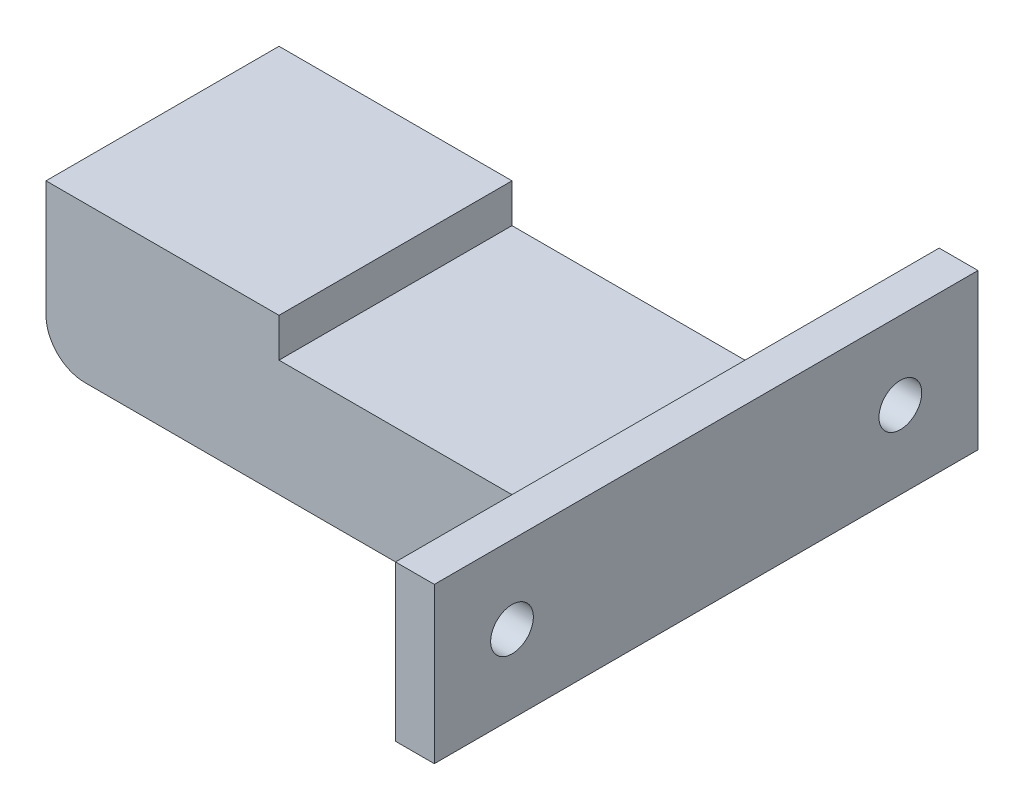
ISO-10303-21;
HEADER;
FILE_DESCRIPTION(('STEP AP214'),'2;1');
FILE_NAME('part.step','',(''),(''),'','','');
FILE_SCHEMA(('AUTOMOTIVE_DESIGN { 1 0 10303 214 1 1 1 1 }'));
ENDSEC;
DATA;
#1=APPLICATION_CONTEXT('core data for automotive mechanical design processes');
#2=APPLICATION_PROTOCOL_DEFINITION('international standard','automotive_design',2000,#1);
#3=PRODUCT_CONTEXT('',#1,'mechanical');
#4=PRODUCT('Part','Part','',(#3));
#5=PRODUCT_RELATED_PRODUCT_CATEGORY('part','',(#4));
#6=PRODUCT_DEFINITION_FORMATION('','',#4);
#7=PRODUCT_DEFINITION_CONTEXT('part definition',#1,'design');
#8=PRODUCT_DEFINITION('design','',#6,#7);
#9=PRODUCT_DEFINITION_SHAPE('','',#8);
#10=(LENGTH_UNIT() NAMED_UNIT(*) SI_UNIT(.MILLI.,.METRE.));
#11=(NAMED_UNIT(*) PLANE_ANGLE_UNIT() SI_UNIT($,.RADIAN.));
#12=(NAMED_UNIT(*) SI_UNIT($,.STERADIAN.) SOLID_ANGLE_UNIT());
#13=UNCERTAINTY_MEASURE_WITH_UNIT(LENGTH_MEASURE(1.E-05),#10,'distance_accuracy_value','');
#14=(GEOMETRIC_REPRESENTATION_CONTEXT(3) GLOBAL_UNCERTAINTY_ASSIGNED_CONTEXT((#13)) GLOBAL_UNIT_ASSIGNED_CONTEXT((#10,
#11,#12)) REPRESENTATION_CONTEXT('',''));
#15=CARTESIAN_POINT('',(0.,0.,0.));
#16=DIRECTION('',(0.,0.,1.));
#17=DIRECTION('',(1.,0.,0.));
#18=AXIS2_PLACEMENT_3D('',#15,#16,#17);
#19=CARTESIAN_POINT('',(0.,20.,0.));
#20=DIRECTION('',(0.,-1.,0.));
#21=DIRECTION('',(0.,0.,-1.));
#22=AXIS2_PLACEMENT_3D('',#19,#20,#21);
#23=PLANE('',#22);
#24=DIRECTION('',(1.,0.,0.));
#25=VECTOR('',#24,1.);
#26=CARTESIAN_POINT('',(65.,20.,-50.));
#27=LINE('',#26,#25);
#28=CARTESIAN_POINT('',(65.,20.,-50.));
#29=VERTEX_POINT('',#28);
#30=CARTESIAN_POINT('',(70.,20.,-50.));
#31=VERTEX_POINT('',#30);
#32=EDGE_CURVE('E198',#29,#31,#27,.T.);
#33=ORIENTED_EDGE('',*,*,#32,.F.);
#34=DIRECTION('',(0.,0.,1.));
#35=VECTOR('',#34,1.);
#36=CARTESIAN_POINT('',(65.,20.,0.));
#37=LINE('',#36,#35);
#38=CARTESIAN_POINT('',(65.,20.,20.));
#39=VERTEX_POINT('',#38);
#40=EDGE_CURVE('E209',#29,#39,#37,.T.);
#41=ORIENTED_EDGE('',*,*,#40,.T.);
#42=DIRECTION('',(1.,0.,0.));
#43=VECTOR('',#42,1.);
#44=CARTESIAN_POINT('',(65.,20.,20.));
#45=LINE('',#44,#43);
#46=CARTESIAN_POINT('',(70.,20.,20.));
#47=VERTEX_POINT('',#46);
#48=EDGE_CURVE('E216',#39,#47,#45,.T.);
#49=ORIENTED_EDGE('',*,*,#48,.T.);
#50=DIRECTION('',(0.,0.,-1.));
#51=VECTOR('',#50,1.);
#52=CARTESIAN_POINT('',(70.,20.,0.));
#53=LINE('',#52,#51);
#54=EDGE_CURVE('E231',#47,#31,#53,.T.);
#55=ORIENTED_EDGE('',*,*,#54,.T.);
#56=EDGE_LOOP('',(#33,#41,#49,#55));
#57=FACE_BOUND('',#56,.T.);
#58=ADVANCED_FACE('F33',(#57),#23,.F.);
#59=CARTESIAN_POINT('',(0.,20.,-30.));
#60=DIRECTION('',(0.,0.,1.));
#61=DIRECTION('',(1.,0.,0.));
#62=AXIS2_PLACEMENT_3D('',#59,#60,#61);
#63=PLANE('',#62);
#64=DIRECTION('',(-1.,0.,0.));
#65=VECTOR('',#64,1.);
#66=CARTESIAN_POINT('',(0.,20.,-30.));
#67=LINE('',#66,#65);
#68=CARTESIAN_POINT('',(30.,20.,-30.));
#69=VERTEX_POINT('',#68);
#70=CARTESIAN_POINT('',(0.,20.,-30.));
#71=VERTEX_POINT('',#70);
#72=EDGE_CURVE('E233',#69,#71,#67,.T.);
#73=ORIENTED_EDGE('',*,*,#72,.F.);
#74=DIRECTION('',(0.,-1.,0.));
#75=VECTOR('',#74,1.);
#76=CARTESIAN_POINT('',(30.,20.,-30.));
#77=LINE('',#76,#75);
#78=CARTESIAN_POINT('',(30.,15.,-30.));
#79=VERTEX_POINT('',#78);
#80=EDGE_CURVE('E178',#69,#79,#77,.T.);
#81=ORIENTED_EDGE('',*,*,#80,.T.);
#82=DIRECTION('',(1.,0.,0.));
#83=VECTOR('',#82,1.);
#84=CARTESIAN_POINT('',(0.,15.,-30.));
#85=LINE('',#84,#83);
#86=CARTESIAN_POINT('',(60.,15.,-30.));
#87=VERTEX_POINT('',#86);
#88=EDGE_CURVE('E134',#79,#87,#85,.T.);
#89=ORIENTED_EDGE('',*,*,#88,.T.);
#90=DIRECTION('',(0.,1.,0.));
#91=VECTOR('',#90,1.);
#92=CARTESIAN_POINT('',(60.,20.,-30.));
#93=LINE('',#92,#91);
#94=CARTESIAN_POINT('',(60.,0.,-30.));
#95=VERTEX_POINT('',#94);
#96=EDGE_CURVE('E151',#87,#95,#93,.F.);
#97=ORIENTED_EDGE('',*,*,#96,.T.);
#98=DIRECTION('',(-1.,0.,0.));
#99=VECTOR('',#98,1.);
#100=CARTESIAN_POINT('',(0.,0.,-30.));
#101=LINE('',#100,#99);
#102=CARTESIAN_POINT('',(5.,0.,-30.));
#103=VERTEX_POINT('',#102);
#104=EDGE_CURVE('E164',#95,#103,#101,.T.);
#105=ORIENTED_EDGE('',*,*,#104,.T.);
#106=CARTESIAN_POINT('',(5.,5.,-30.));
#107=DIRECTION('',(0.,0.,1.));
#108=DIRECTION('',(1.,0.,0.));
#109=AXIS2_PLACEMENT_3D('',#106,#107,#108);
#110=CIRCLE('',#109,5.);
#111=CARTESIAN_POINT('',(0.,5.,-30.));
#112=VERTEX_POINT('',#111);
#113=EDGE_CURVE('E148',#103,#112,#110,.F.);
#114=ORIENTED_EDGE('',*,*,#113,.T.);
#115=DIRECTION('',(0.,-1.,0.));
#116=VECTOR('',#115,1.);
#117=CARTESIAN_POINT('',(0.,20.,-30.));
#118=LINE('',#117,#116);
#119=EDGE_CURVE('E235',#71,#112,#118,.T.);
#120=ORIENTED_EDGE('',*,*,#119,.F.);
#121=EDGE_LOOP('',(#73,#81,#89,#97,#105,#114,#120));
#122=FACE_BOUND('',#121,.T.);
#123=ADVANCED_FACE('F177',(#122),#63,.F.);
#124=CARTESIAN_POINT('',(0.,20.,0.));
#125=DIRECTION('',(1.,0.,0.));
#126=DIRECTION('',(0.,0.,-1.));
#127=AXIS2_PLACEMENT_3D('',#124,#125,#126);
#128=PLANE('',#127);
#129=ORIENTED_EDGE('',*,*,#119,.T.);
#130=DIRECTION('',(0.,0.,1.));
#131=VECTOR('',#130,1.);
#132=CARTESIAN_POINT('',(0.,5.,0.));
#133=LINE('',#132,#131);
#134=CARTESIAN_POINT('',(0.,5.,0.));
#135=VERTEX_POINT('',#134);
#136=EDGE_CURVE('E246',#112,#135,#133,.T.);
#137=ORIENTED_EDGE('',*,*,#136,.T.);
#138=DIRECTION('',(0.,-1.,0.));
#139=VECTOR('',#138,1.);
#140=CARTESIAN_POINT('',(0.,20.,0.));
#141=LINE('',#140,#139);
#142=CARTESIAN_POINT('',(0.,20.,0.));
#143=VERTEX_POINT('',#142);
#144=EDGE_CURVE('E243',#143,#135,#141,.T.);
#145=ORIENTED_EDGE('',*,*,#144,.F.);
#146=DIRECTION('',(0.,0.,1.));
#147=VECTOR('',#146,1.);
#148=CARTESIAN_POINT('',(0.,20.,0.));
#149=LINE('',#148,#147);
#150=EDGE_CURVE('E225',#71,#143,#149,.T.);
#151=ORIENTED_EDGE('',*,*,#150,.F.);
#152=EDGE_LOOP('',(#129,#137,#145,#151));
#153=FACE_BOUND('',#152,.T.);
#154=ADVANCED_FACE('F262',(#153),#128,.F.);
#155=CARTESIAN_POINT('',(0.,20.,0.));
#156=DIRECTION('',(0.,0.,-1.));
#157=DIRECTION('',(-1.,0.,0.));
#158=AXIS2_PLACEMENT_3D('',#155,#156,#157);
#159=PLANE('',#158);
#160=DIRECTION('',(-1.,0.,0.));
#161=VECTOR('',#160,1.);
#162=CARTESIAN_POINT('',(0.,15.,0.));
#163=LINE('',#162,#161);
#164=CARTESIAN_POINT('',(60.,15.,0.));
#165=VERTEX_POINT('',#164);
#166=CARTESIAN_POINT('',(30.,15.,0.));
#167=VERTEX_POINT('',#166);
#168=EDGE_CURVE('E130',#165,#167,#163,.T.);
#169=ORIENTED_EDGE('',*,*,#168,.T.);
#170=DIRECTION('',(0.,1.,0.));
#171=VECTOR('',#170,1.);
#172=CARTESIAN_POINT('',(30.,20.,0.));
#173=LINE('',#172,#171);
#174=CARTESIAN_POINT('',(30.,20.,0.));
#175=VERTEX_POINT('',#174);
#176=EDGE_CURVE('E184',#167,#175,#173,.T.);
#177=ORIENTED_EDGE('',*,*,#176,.T.);
#178=DIRECTION('',(1.,0.,0.));
#179=VECTOR('',#178,1.);
#180=CARTESIAN_POINT('',(0.,20.,0.));
#181=LINE('',#180,#179);
#182=EDGE_CURVE('E228',#143,#175,#181,.T.);
#183=ORIENTED_EDGE('',*,*,#182,.F.);
#184=ORIENTED_EDGE('',*,*,#144,.T.);
#185=CARTESIAN_POINT('',(5.,5.,0.));
#186=DIRECTION('',(0.,0.,-1.));
#187=DIRECTION('',(-1.,0.,0.));
#188=AXIS2_PLACEMENT_3D('',#185,#186,#187);
#189=CIRCLE('',#188,5.);
#190=CARTESIAN_POINT('',(5.,0.,0.));
#191=VERTEX_POINT('',#190);
#192=EDGE_CURVE('E251',#135,#191,#189,.F.);
#193=ORIENTED_EDGE('',*,*,#192,.T.);
#194=DIRECTION('',(1.,0.,0.));
#195=VECTOR('',#194,1.);
#196=CARTESIAN_POINT('',(0.,0.,0.));
#197=LINE('',#196,#195);
#198=CARTESIAN_POINT('',(60.,0.,0.));
#199=VERTEX_POINT('',#198);
#200=EDGE_CURVE('E222',#191,#199,#197,.T.);
#201=ORIENTED_EDGE('',*,*,#200,.T.);
#202=DIRECTION('',(0.,1.,0.));
#203=VECTOR('',#202,1.);
#204=CARTESIAN_POINT('',(60.,20.,0.));
#205=LINE('',#204,#203);
#206=EDGE_CURVE('E249',#199,#165,#205,.T.);
#207=ORIENTED_EDGE('',*,*,#206,.T.);
#208=EDGE_LOOP('',(#169,#177,#183,#184,#193,#201,#207));
#209=FACE_BOUND('',#208,.T.);
#210=ADVANCED_FACE('F265',(#209),#159,.F.);
#211=CARTESIAN_POINT('',(70.,20.,0.));
#212=DIRECTION('',(-1.,0.,0.));
#213=DIRECTION('',(0.,0.,1.));
#214=AXIS2_PLACEMENT_3D('',#211,#212,#213);
#215=PLANE('',#214);
#216=DIRECTION('',(0.,0.,-1.));
#217=VECTOR('',#216,1.);
#218=CARTESIAN_POINT('',(70.,0.,0.));
#219=LINE('',#218,#217);
#220=CARTESIAN_POINT('',(70.,0.,20.));
#221=VERTEX_POINT('',#220);
#222=CARTESIAN_POINT('',(70.,0.,-50.));
#223=VERTEX_POINT('',#222);
#224=EDGE_CURVE('E238',#221,#223,#219,.T.);
#225=ORIENTED_EDGE('',*,*,#224,.T.);
#226=DIRECTION('',(0.,-1.,0.));
#227=VECTOR('',#226,1.);
#228=CARTESIAN_POINT('',(70.,20.,-50.));
#229=LINE('',#228,#227);
#230=EDGE_CURVE('E170',#31,#223,#229,.T.);
#231=ORIENTED_EDGE('',*,*,#230,.F.);
#232=ORIENTED_EDGE('',*,*,#54,.F.);
#233=DIRECTION('',(0.,-1.,0.));
#234=VECTOR('',#233,1.);
#235=CARTESIAN_POINT('',(70.,20.,20.));
#236=LINE('',#235,#234);
#237=EDGE_CURVE('E206',#47,#221,#236,.T.);
#238=ORIENTED_EDGE('',*,*,#237,.T.);
#239=EDGE_LOOP('',(#225,#231,#232,#238));
#240=FACE_BOUND('',#239,.T.);
#241=CARTESIAN_POINT('',(70.,10.,10.));
#242=DIRECTION('',(1.,0.,0.));
#243=DIRECTION('',(0.,0.,-1.));
#244=AXIS2_PLACEMENT_3D('',#241,#242,#243);
#245=CIRCLE('',#244,2.75);
#246=CARTESIAN_POINT('',(70.,10.,7.25));
#247=VERTEX_POINT('',#246);
#248=EDGE_CURVE('E201',#247,#247,#245,.T.);
#249=ORIENTED_EDGE('',*,*,#248,.F.);
#250=EDGE_LOOP('',(#249));
#251=FACE_BOUND('',#250,.T.);
#252=CARTESIAN_POINT('',(70.,10.,-40.));
#253=DIRECTION('',(-1.,0.,0.));
#254=DIRECTION('',(0.,0.,1.));
#255=AXIS2_PLACEMENT_3D('',#252,#253,#254);
#256=CIRCLE('',#255,2.75);
#257=CARTESIAN_POINT('',(70.,10.,-37.25));
#258=VERTEX_POINT('',#257);
#259=EDGE_CURVE('E188',#258,#258,#256,.T.);
#260=ORIENTED_EDGE('',*,*,#259,.T.);
#261=EDGE_LOOP('',(#260));
#262=FACE_BOUND('',#261,.T.);
#263=ADVANCED_FACE('F290',(#240,#251,#262),#215,.F.);
#264=ORIENTED_EDGE('',*,*,#182,.T.);
#265=DIRECTION('',(0.,0.,1.));
#266=VECTOR('',#265,1.);
#267=CARTESIAN_POINT('',(30.,20.,-35.));
#268=LINE('',#267,#266);
#269=EDGE_CURVE('E143',#69,#175,#268,.T.);
#270=ORIENTED_EDGE('',*,*,#269,.F.);
#271=ORIENTED_EDGE('',*,*,#72,.T.);
#272=ORIENTED_EDGE('',*,*,#150,.T.);
#273=EDGE_LOOP('',(#264,#270,#271,#272));
#274=FACE_BOUND('',#273,.T.);
#275=ADVANCED_FACE('F268',(#274),#23,.F.);
#276=CARTESIAN_POINT('',(0.,0.,0.));
#277=DIRECTION('',(0.,-1.,0.));
#278=DIRECTION('',(0.,0.,-1.));
#279=AXIS2_PLACEMENT_3D('',#276,#277,#278);
#280=PLANE('',#279);
#281=ORIENTED_EDGE('',*,*,#200,.F.);
#282=DIRECTION('',(0.,0.,1.));
#283=VECTOR('',#282,1.);
#284=CARTESIAN_POINT('',(5.,0.,-30.));
#285=LINE('',#284,#283);
#286=EDGE_CURVE('E253',#191,#103,#285,.F.);
#287=ORIENTED_EDGE('',*,*,#286,.T.);
#288=ORIENTED_EDGE('',*,*,#104,.F.);
#289=CARTESIAN_POINT('',(60.,0.,-35.));
#290=DIRECTION('',(0.,-1.,0.));
#291=DIRECTION('',(0.,0.,-1.));
#292=AXIS2_PLACEMENT_3D('',#289,#290,#291);
#293=CIRCLE('',#292,5.);
#294=CARTESIAN_POINT('',(65.,0.,-35.));
#295=VERTEX_POINT('',#294);
#296=EDGE_CURVE('E41',#95,#295,#293,.F.);
#297=ORIENTED_EDGE('',*,*,#296,.T.);
#298=DIRECTION('',(0.,0.,1.));
#299=VECTOR('',#298,1.);
#300=CARTESIAN_POINT('',(65.,0.,-30.));
#301=LINE('',#300,#299);
#302=CARTESIAN_POINT('',(65.,0.,-50.));
#303=VERTEX_POINT('',#302);
#304=EDGE_CURVE('E162',#303,#295,#301,.T.);
#305=ORIENTED_EDGE('',*,*,#304,.F.);
#306=DIRECTION('',(1.,0.,0.));
#307=VECTOR('',#306,1.);
#308=CARTESIAN_POINT('',(65.,0.,-50.));
#309=LINE('',#308,#307);
#310=EDGE_CURVE('E195',#303,#223,#309,.T.);
#311=ORIENTED_EDGE('',*,*,#310,.T.);
#312=ORIENTED_EDGE('',*,*,#224,.F.);
#313=DIRECTION('',(1.,0.,0.));
#314=VECTOR('',#313,1.);
#315=CARTESIAN_POINT('',(65.,0.,20.));
#316=LINE('',#315,#314);
#317=CARTESIAN_POINT('',(65.,0.,20.));
#318=VERTEX_POINT('',#317);
#319=EDGE_CURVE('E219',#318,#221,#316,.T.);
#320=ORIENTED_EDGE('',*,*,#319,.F.);
#321=DIRECTION('',(0.,0.,-1.));
#322=VECTOR('',#321,1.);
#323=CARTESIAN_POINT('',(65.,0.,0.));
#324=LINE('',#323,#322);
#325=CARTESIAN_POINT('',(65.,0.,5.));
#326=VERTEX_POINT('',#325);
#327=EDGE_CURVE('E214',#318,#326,#324,.T.);
#328=ORIENTED_EDGE('',*,*,#327,.T.);
#329=CARTESIAN_POINT('',(60.,0.,5.));
#330=DIRECTION('',(0.,-1.,0.));
#331=DIRECTION('',(0.,0.,-1.));
#332=AXIS2_PLACEMENT_3D('',#329,#330,#331);
#333=CIRCLE('',#332,5.);
#334=EDGE_CURVE('E147',#326,#199,#333,.F.);
#335=ORIENTED_EDGE('',*,*,#334,.T.);
#336=EDGE_LOOP('',(#281,#287,#288,#297,#305,#311,#312,#320,#328,#335));
#337=FACE_BOUND('',#336,.T.);
#338=ADVANCED_FACE('F160',(#337),#280,.T.);
#339=CARTESIAN_POINT('',(65.,20.,20.));
#340=DIRECTION('',(0.,0.,1.));
#341=DIRECTION('',(1.,0.,0.));
#342=AXIS2_PLACEMENT_3D('',#339,#340,#341);
#343=PLANE('',#342);
#344=ORIENTED_EDGE('',*,*,#237,.F.);
#345=ORIENTED_EDGE('',*,*,#48,.F.);
#346=DIRECTION('',(0.,-1.,0.));
#347=VECTOR('',#346,1.);
#348=CARTESIAN_POINT('',(65.,20.,20.));
#349=LINE('',#348,#347);
#350=EDGE_CURVE('E211',#39,#318,#349,.T.);
#351=ORIENTED_EDGE('',*,*,#350,.T.);
#352=ORIENTED_EDGE('',*,*,#319,.T.);
#353=EDGE_LOOP('',(#344,#345,#351,#352));
#354=FACE_BOUND('',#353,.T.);
#355=ADVANCED_FACE('F295',(#354),#343,.T.);
#356=CARTESIAN_POINT('',(65.,0.,0.));
#357=DIRECTION('',(-1.,0.,0.));
#358=DIRECTION('',(0.,0.,1.));
#359=AXIS2_PLACEMENT_3D('',#356,#357,#358);
#360=PLANE('',#359);
#361=CARTESIAN_POINT('',(65.,10.,10.));
#362=DIRECTION('',(1.,0.,0.));
#363=DIRECTION('',(0.,0.,-1.));
#364=AXIS2_PLACEMENT_3D('',#361,#362,#363);
#365=CIRCLE('',#364,2.75);
#366=CARTESIAN_POINT('',(65.,10.,7.25));
#367=VERTEX_POINT('',#366);
#368=EDGE_CURVE('E203',#367,#367,#365,.T.);
#369=ORIENTED_EDGE('',*,*,#368,.T.);
#370=EDGE_LOOP('',(#369));
#371=FACE_BOUND('',#370,.T.);
#372=ORIENTED_EDGE('',*,*,#40,.F.);
#373=DIRECTION('',(0.,-1.,0.));
#374=VECTOR('',#373,1.);
#375=CARTESIAN_POINT('',(65.,20.,-50.));
#376=LINE('',#375,#374);
#377=EDGE_CURVE('E168',#29,#303,#376,.T.);
#378=ORIENTED_EDGE('',*,*,#377,.T.);
#379=ORIENTED_EDGE('',*,*,#304,.T.);
#380=DIRECTION('',(0.,1.,0.));
#381=VECTOR('',#380,1.);
#382=CARTESIAN_POINT('',(65.,0.,-35.));
#383=LINE('',#382,#381);
#384=CARTESIAN_POINT('',(65.,15.,-35.));
#385=VERTEX_POINT('',#384);
#386=EDGE_CURVE('E141',#295,#385,#383,.T.);
#387=ORIENTED_EDGE('',*,*,#386,.T.);
#388=DIRECTION('',(0.,0.,-1.));
#389=VECTOR('',#388,1.);
#390=CARTESIAN_POINT('',(65.,15.,-35.));
#391=LINE('',#390,#389);
#392=CARTESIAN_POINT('',(65.,15.,5.));
#393=VERTEX_POINT('',#392);
#394=EDGE_CURVE('E48',#393,#385,#391,.T.);
#395=ORIENTED_EDGE('',*,*,#394,.F.);
#396=DIRECTION('',(0.,1.,0.));
#397=VECTOR('',#396,1.);
#398=CARTESIAN_POINT('',(65.,0.,5.));
#399=LINE('',#398,#397);
#400=EDGE_CURVE('E54',#393,#326,#399,.F.);
#401=ORIENTED_EDGE('',*,*,#400,.T.);
#402=ORIENTED_EDGE('',*,*,#327,.F.);
#403=ORIENTED_EDGE('',*,*,#350,.F.);
#404=EDGE_LOOP('',(#372,#378,#379,#387,#395,#401,#402,#403));
#405=FACE_BOUND('',#404,.T.);
#406=CARTESIAN_POINT('',(65.,10.,-40.));
#407=DIRECTION('',(-1.,0.,0.));
#408=DIRECTION('',(0.,0.,1.));
#409=AXIS2_PLACEMENT_3D('',#406,#407,#408);
#410=CIRCLE('',#409,2.75);
#411=CARTESIAN_POINT('',(65.,10.,-37.25));
#412=VERTEX_POINT('',#411);
#413=EDGE_CURVE('E189',#412,#412,#410,.T.);
#414=ORIENTED_EDGE('',*,*,#413,.F.);
#415=EDGE_LOOP('',(#414));
#416=FACE_BOUND('',#415,.T.);
#417=ADVANCED_FACE('F137',(#371,#405,#416),#360,.T.);
#418=CARTESIAN_POINT('',(65.,10.,10.));
#419=DIRECTION('',(1.,0.,0.));
#420=DIRECTION('',(0.,0.,-1.));
#421=AXIS2_PLACEMENT_3D('',#418,#419,#420);
#422=CYLINDRICAL_SURFACE('',#421,2.75);
#423=ORIENTED_EDGE('',*,*,#368,.F.);
#424=EDGE_LOOP('',(#423));
#425=FACE_BOUND('',#424,.T.);
#426=ORIENTED_EDGE('',*,*,#248,.T.);
#427=EDGE_LOOP('',(#426));
#428=FACE_BOUND('',#427,.T.);
#429=ADVANCED_FACE('F339',(#425,#428),#422,.F.);
#430=CARTESIAN_POINT('',(65.,20.,-50.));
#431=DIRECTION('',(0.,0.,1.));
#432=DIRECTION('',(1.,0.,0.));
#433=AXIS2_PLACEMENT_3D('',#430,#431,#432);
#434=PLANE('',#433);
#435=ORIENTED_EDGE('',*,*,#230,.T.);
#436=ORIENTED_EDGE('',*,*,#310,.F.);
#437=ORIENTED_EDGE('',*,*,#377,.F.);
#438=ORIENTED_EDGE('',*,*,#32,.T.);
#439=EDGE_LOOP('',(#435,#436,#437,#438));
#440=FACE_BOUND('',#439,.T.);
#441=ADVANCED_FACE('F396',(#440),#434,.F.);
#442=CARTESIAN_POINT('',(65.,10.,-40.));
#443=DIRECTION('',(1.,0.,0.));
#444=DIRECTION('',(0.,0.,-1.));
#445=AXIS2_PLACEMENT_3D('',#442,#443,#444);
#446=CYLINDRICAL_SURFACE('',#445,2.75);
#447=ORIENTED_EDGE('',*,*,#413,.T.);
#448=EDGE_LOOP('',(#447));
#449=FACE_BOUND('',#448,.T.);
#450=ORIENTED_EDGE('',*,*,#259,.F.);
#451=EDGE_LOOP('',(#450));
#452=FACE_BOUND('',#451,.T.);
#453=ADVANCED_FACE('F307',(#449,#452),#446,.F.);
#454=CARTESIAN_POINT('',(5.,5.,0.));
#455=DIRECTION('',(0.,0.,-1.));
#456=DIRECTION('',(-1.,0.,0.));
#457=AXIS2_PLACEMENT_3D('',#454,#455,#456);
#458=CYLINDRICAL_SURFACE('',#457,5.);
#459=ORIENTED_EDGE('',*,*,#113,.F.);
#460=ORIENTED_EDGE('',*,*,#286,.F.);
#461=ORIENTED_EDGE('',*,*,#192,.F.);
#462=ORIENTED_EDGE('',*,*,#136,.F.);
#463=EDGE_LOOP('',(#459,#460,#461,#462));
#464=FACE_BOUND('',#463,.T.);
#465=ADVANCED_FACE('F259',(#464),#458,.T.);
#466=CARTESIAN_POINT('',(60.,20.,5.));
#467=DIRECTION('',(0.,1.,0.));
#468=DIRECTION('',(0.,0.,1.));
#469=AXIS2_PLACEMENT_3D('',#466,#467,#468);
#470=CYLINDRICAL_SURFACE('',#469,5.);
#471=ORIENTED_EDGE('',*,*,#400,.F.);
#472=CARTESIAN_POINT('',(60.,15.,5.));
#473=DIRECTION('',(0.,-1.,0.));
#474=DIRECTION('',(0.,0.,-1.));
#475=AXIS2_PLACEMENT_3D('',#472,#473,#474);
#476=CIRCLE('',#475,5.);
#477=EDGE_CURVE('E126',#393,#165,#476,.F.);
#478=ORIENTED_EDGE('',*,*,#477,.T.);
#479=ORIENTED_EDGE('',*,*,#206,.F.);
#480=ORIENTED_EDGE('',*,*,#334,.F.);
#481=EDGE_LOOP('',(#471,#478,#479,#480));
#482=FACE_BOUND('',#481,.T.);
#483=ADVANCED_FACE('F146',(#482),#470,.F.);
#484=CARTESIAN_POINT('',(60.,0.,-35.));
#485=DIRECTION('',(0.,1.,0.));
#486=DIRECTION('',(0.,0.,1.));
#487=AXIS2_PLACEMENT_3D('',#484,#485,#486);
#488=CYLINDRICAL_SURFACE('',#487,5.);
#489=ORIENTED_EDGE('',*,*,#96,.F.);
#490=CARTESIAN_POINT('',(60.,15.,-35.));
#491=DIRECTION('',(0.,-1.,0.));
#492=DIRECTION('',(0.,0.,-1.));
#493=AXIS2_PLACEMENT_3D('',#490,#491,#492);
#494=CIRCLE('',#493,5.);
#495=EDGE_CURVE('E11',#87,#385,#494,.F.);
#496=ORIENTED_EDGE('',*,*,#495,.T.);
#497=ORIENTED_EDGE('',*,*,#386,.F.);
#498=ORIENTED_EDGE('',*,*,#296,.F.);
#499=EDGE_LOOP('',(#489,#496,#497,#498));
#500=FACE_BOUND('',#499,.T.);
#501=ADVANCED_FACE('F35',(#500),#488,.F.);
#502=CARTESIAN_POINT('',(30.,15.,-35.));
#503=DIRECTION('',(-1.,0.,0.));
#504=DIRECTION('',(0.,0.,1.));
#505=AXIS2_PLACEMENT_3D('',#502,#503,#504);
#506=PLANE('',#505);
#507=ORIENTED_EDGE('',*,*,#269,.T.);
#508=ORIENTED_EDGE('',*,*,#176,.F.);
#509=DIRECTION('',(0.,0.,1.));
#510=VECTOR('',#509,1.);
#511=CARTESIAN_POINT('',(30.,15.,-35.));
#512=LINE('',#511,#510);
#513=EDGE_CURVE('E142',#79,#167,#512,.T.);
#514=ORIENTED_EDGE('',*,*,#513,.F.);
#515=ORIENTED_EDGE('',*,*,#80,.F.);
#516=EDGE_LOOP('',(#507,#508,#514,#515));
#517=FACE_BOUND('',#516,.T.);
#518=ADVANCED_FACE('F270',(#517),#506,.F.);
#519=CARTESIAN_POINT('',(0.,15.,0.));
#520=DIRECTION('',(0.,-1.,0.));
#521=DIRECTION('',(0.,0.,-1.));
#522=AXIS2_PLACEMENT_3D('',#519,#520,#521);
#523=PLANE('',#522);
#524=ORIENTED_EDGE('',*,*,#477,.F.);
#525=ORIENTED_EDGE('',*,*,#394,.T.);
#526=ORIENTED_EDGE('',*,*,#495,.F.);
#527=ORIENTED_EDGE('',*,*,#88,.F.);
#528=ORIENTED_EDGE('',*,*,#513,.T.);
#529=ORIENTED_EDGE('',*,*,#168,.F.);
#530=EDGE_LOOP('',(#524,#525,#526,#527,#528,#529));
#531=FACE_BOUND('',#530,.T.);
#532=ADVANCED_FACE('F127',(#531),#523,.F.);
#533=CLOSED_SHELL('',(#58,#123,#154,#210,#263,#275,#338,#355,#417,#429,#441,#453,#465,#483,#501,
#518,#532));
#534=MANIFOLD_SOLID_BREP('B2',#533);
#535=ADVANCED_BREP_SHAPE_REPRESENTATION('',(#18,#534),#14);
#536=SHAPE_DEFINITION_REPRESENTATION(#9,#535);
ENDSEC;
END-ISO-10303-21;
